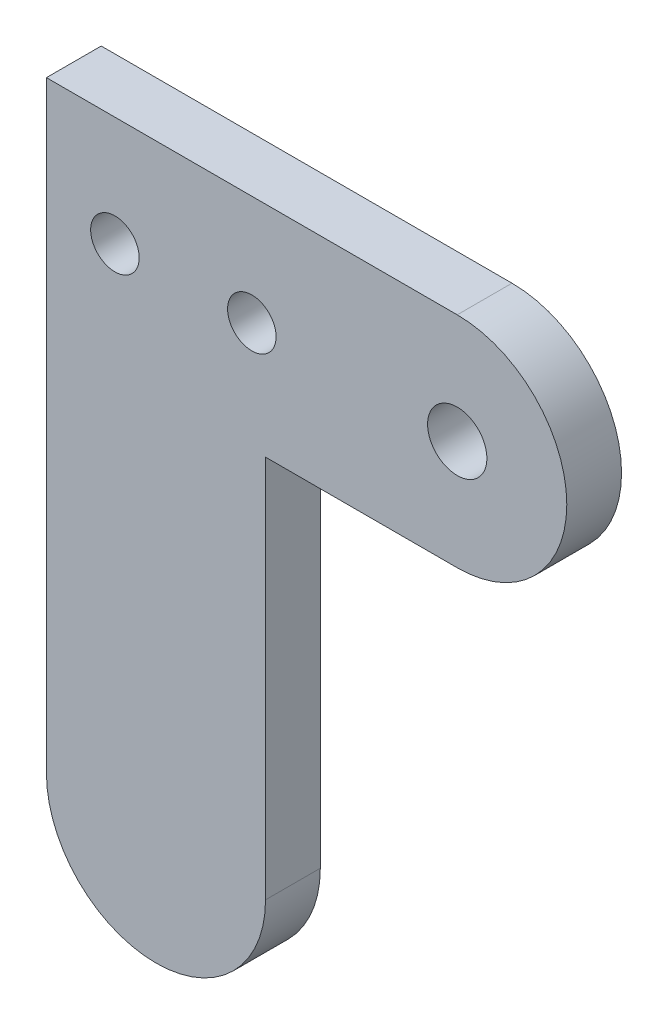
ISO-10303-21;
HEADER;
FILE_DESCRIPTION(('STEP AP214'),'2;1');
FILE_NAME('part.step','',(''),(''),'','','');
FILE_SCHEMA(('AUTOMOTIVE_DESIGN { 1 0 10303 214 1 1 1 1 }'));
ENDSEC;
DATA;
#1=APPLICATION_CONTEXT('core data for automotive mechanical design processes');
#2=APPLICATION_PROTOCOL_DEFINITION('international standard','automotive_design',2000,#1);
#3=PRODUCT_CONTEXT('',#1,'mechanical');
#4=PRODUCT('Part','Part','',(#3));
#5=PRODUCT_RELATED_PRODUCT_CATEGORY('part','',(#4));
#6=PRODUCT_DEFINITION_FORMATION('','',#4);
#7=PRODUCT_DEFINITION_CONTEXT('part definition',#1,'design');
#8=PRODUCT_DEFINITION('design','',#6,#7);
#9=PRODUCT_DEFINITION_SHAPE('','',#8);
#10=(LENGTH_UNIT() NAMED_UNIT(*) SI_UNIT(.MILLI.,.METRE.));
#11=(NAMED_UNIT(*) PLANE_ANGLE_UNIT() SI_UNIT($,.RADIAN.));
#12=(NAMED_UNIT(*) SI_UNIT($,.STERADIAN.) SOLID_ANGLE_UNIT());
#13=UNCERTAINTY_MEASURE_WITH_UNIT(LENGTH_MEASURE(1.E-05),#10,'distance_accuracy_value','');
#14=(GEOMETRIC_REPRESENTATION_CONTEXT(3) GLOBAL_UNCERTAINTY_ASSIGNED_CONTEXT((#13)) GLOBAL_UNIT_ASSIGNED_CONTEXT((#10,
#11,#12)) REPRESENTATION_CONTEXT('',''));
#15=CARTESIAN_POINT('',(0.,0.,0.));
#16=DIRECTION('',(0.,0.,1.));
#17=DIRECTION('',(1.,0.,0.));
#18=AXIS2_PLACEMENT_3D('',#15,#16,#17);
#19=CARTESIAN_POINT('',(38.1,10.16,5.08));
#20=DIRECTION('',(0.,-1.,0.));
#21=DIRECTION('',(1.,0.,0.));
#22=AXIS2_PLACEMENT_3D('',#19,#20,#21);
#23=PLANE('',#22);
#24=DIRECTION('',(-1.,0.,0.));
#25=VECTOR('',#24,1.);
#26=CARTESIAN_POINT('',(38.1,10.16,0.));
#27=LINE('',#26,#25);
#28=CARTESIAN_POINT('',(38.1,10.16,0.));
#29=VERTEX_POINT('',#28);
#30=CARTESIAN_POINT('',(0.,10.16,0.));
#31=VERTEX_POINT('',#30);
#32=EDGE_CURVE('E121',#29,#31,#27,.T.);
#33=ORIENTED_EDGE('',*,*,#32,.T.);
#34=DIRECTION('',(0.,0.,-1.));
#35=VECTOR('',#34,1.);
#36=CARTESIAN_POINT('',(0.,10.16,5.08));
#37=LINE('',#36,#35);
#38=CARTESIAN_POINT('',(0.,10.16,5.08));
#39=VERTEX_POINT('',#38);
#40=EDGE_CURVE('E11',#39,#31,#37,.T.);
#41=ORIENTED_EDGE('',*,*,#40,.F.);
#42=DIRECTION('',(-1.,0.,0.));
#43=VECTOR('',#42,1.);
#44=CARTESIAN_POINT('',(38.1,10.16,5.08));
#45=LINE('',#44,#43);
#46=CARTESIAN_POINT('',(38.1,10.16,5.08));
#47=VERTEX_POINT('',#46);
#48=EDGE_CURVE('E132',#47,#39,#45,.T.);
#49=ORIENTED_EDGE('',*,*,#48,.F.);
#50=DIRECTION('',(0.,0.,-1.));
#51=VECTOR('',#50,1.);
#52=CARTESIAN_POINT('',(38.1,10.16,5.08));
#53=LINE('',#52,#51);
#54=EDGE_CURVE('E117',#47,#29,#53,.T.);
#55=ORIENTED_EDGE('',*,*,#54,.T.);
#56=EDGE_LOOP('',(#33,#41,#49,#55));
#57=FACE_BOUND('',#56,.T.);
#58=ADVANCED_FACE('F37',(#57),#23,.F.);
#59=CARTESIAN_POINT('',(0.,-45.72,5.08));
#60=DIRECTION('',(1.,0.,0.));
#61=DIRECTION('',(0.,1.,0.));
#62=AXIS2_PLACEMENT_3D('',#59,#60,#61);
#63=PLANE('',#62);
#64=DIRECTION('',(0.,-1.,0.));
#65=VECTOR('',#64,1.);
#66=CARTESIAN_POINT('',(0.,-45.72,0.));
#67=LINE('',#66,#65);
#68=CARTESIAN_POINT('',(0.,-45.72,0.));
#69=VERTEX_POINT('',#68);
#70=EDGE_CURVE('E124',#31,#69,#67,.T.);
#71=ORIENTED_EDGE('',*,*,#70,.T.);
#72=DIRECTION('',(0.,0.,-1.));
#73=VECTOR('',#72,1.);
#74=CARTESIAN_POINT('',(0.,-45.72,5.08));
#75=LINE('',#74,#73);
#76=CARTESIAN_POINT('',(0.,-45.72,5.08));
#77=VERTEX_POINT('',#76);
#78=EDGE_CURVE('E45',#77,#69,#75,.T.);
#79=ORIENTED_EDGE('',*,*,#78,.F.);
#80=DIRECTION('',(0.,-1.,0.));
#81=VECTOR('',#80,1.);
#82=CARTESIAN_POINT('',(0.,10.16,5.08));
#83=LINE('',#82,#81);
#84=EDGE_CURVE('E90',#39,#77,#83,.T.);
#85=ORIENTED_EDGE('',*,*,#84,.F.);
#86=ORIENTED_EDGE('',*,*,#40,.T.);
#87=EDGE_LOOP('',(#71,#79,#85,#86));
#88=FACE_BOUND('',#87,.T.);
#89=ADVANCED_FACE('F157',(#88),#63,.F.);
#90=CARTESIAN_POINT('',(10.16,-45.72,5.08));
#91=DIRECTION('',(0.,0.,-1.));
#92=DIRECTION('',(-1.,0.,0.));
#93=AXIS2_PLACEMENT_3D('',#90,#91,#92);
#94=CYLINDRICAL_SURFACE('',#93,10.16);
#95=CARTESIAN_POINT('',(10.16,-45.72,0.));
#96=DIRECTION('',(0.,0.,1.));
#97=DIRECTION('',(-1.,0.,0.));
#98=AXIS2_PLACEMENT_3D('',#95,#96,#97);
#99=CIRCLE('',#98,10.16);
#100=CARTESIAN_POINT('',(20.32,-45.72,0.));
#101=VERTEX_POINT('',#100);
#102=EDGE_CURVE('E127',#69,#101,#99,.T.);
#103=ORIENTED_EDGE('',*,*,#102,.T.);
#104=DIRECTION('',(0.,0.,-1.));
#105=VECTOR('',#104,1.);
#106=CARTESIAN_POINT('',(20.32,-45.72,5.08));
#107=LINE('',#106,#105);
#108=CARTESIAN_POINT('',(20.32,-45.72,5.08));
#109=VERTEX_POINT('',#108);
#110=EDGE_CURVE('E112',#109,#101,#107,.T.);
#111=ORIENTED_EDGE('',*,*,#110,.F.);
#112=CARTESIAN_POINT('',(10.16,-45.72,5.08));
#113=DIRECTION('',(0.,0.,1.));
#114=DIRECTION('',(-1.,0.,0.));
#115=AXIS2_PLACEMENT_3D('',#112,#113,#114);
#116=CIRCLE('',#115,10.16);
#117=EDGE_CURVE('E103',#77,#109,#116,.T.);
#118=ORIENTED_EDGE('',*,*,#117,.F.);
#119=ORIENTED_EDGE('',*,*,#78,.T.);
#120=EDGE_LOOP('',(#103,#111,#118,#119));
#121=FACE_BOUND('',#120,.T.);
#122=ADVANCED_FACE('F138',(#121),#94,.T.);
#123=CARTESIAN_POINT('',(20.32,-10.16,5.08));
#124=DIRECTION('',(-1.,0.,0.));
#125=DIRECTION('',(0.,-1.,0.));
#126=AXIS2_PLACEMENT_3D('',#123,#124,#125);
#127=PLANE('',#126);
#128=DIRECTION('',(0.,1.,0.));
#129=VECTOR('',#128,1.);
#130=CARTESIAN_POINT('',(20.32,-10.16,0.));
#131=LINE('',#130,#129);
#132=CARTESIAN_POINT('',(20.32,-10.16,0.));
#133=VERTEX_POINT('',#132);
#134=EDGE_CURVE('E111',#101,#133,#131,.T.);
#135=ORIENTED_EDGE('',*,*,#134,.T.);
#136=DIRECTION('',(0.,0.,-1.));
#137=VECTOR('',#136,1.);
#138=CARTESIAN_POINT('',(20.32,-10.16,5.08));
#139=LINE('',#138,#137);
#140=CARTESIAN_POINT('',(20.32,-10.16,5.08));
#141=VERTEX_POINT('',#140);
#142=EDGE_CURVE('E108',#141,#133,#139,.T.);
#143=ORIENTED_EDGE('',*,*,#142,.F.);
#144=DIRECTION('',(0.,1.,0.));
#145=VECTOR('',#144,1.);
#146=CARTESIAN_POINT('',(20.32,-10.16,5.08));
#147=LINE('',#146,#145);
#148=EDGE_CURVE('E97',#109,#141,#147,.T.);
#149=ORIENTED_EDGE('',*,*,#148,.F.);
#150=ORIENTED_EDGE('',*,*,#110,.T.);
#151=EDGE_LOOP('',(#135,#143,#149,#150));
#152=FACE_BOUND('',#151,.T.);
#153=ADVANCED_FACE('F109',(#152),#127,.F.);
#154=CARTESIAN_POINT('',(38.1,-10.16,5.08));
#155=DIRECTION('',(0.,1.,0.));
#156=DIRECTION('',(-1.,0.,0.));
#157=AXIS2_PLACEMENT_3D('',#154,#155,#156);
#158=PLANE('',#157);
#159=DIRECTION('',(1.,0.,0.));
#160=VECTOR('',#159,1.);
#161=CARTESIAN_POINT('',(38.1,-10.16,0.));
#162=LINE('',#161,#160);
#163=CARTESIAN_POINT('',(38.1,-10.16,0.));
#164=VERTEX_POINT('',#163);
#165=EDGE_CURVE('E76',#133,#164,#162,.T.);
#166=ORIENTED_EDGE('',*,*,#165,.T.);
#167=DIRECTION('',(0.,0.,-1.));
#168=VECTOR('',#167,1.);
#169=CARTESIAN_POINT('',(38.1,-10.16,5.08));
#170=LINE('',#169,#168);
#171=CARTESIAN_POINT('',(38.1,-10.16,5.08));
#172=VERTEX_POINT('',#171);
#173=EDGE_CURVE('E113',#172,#164,#170,.T.);
#174=ORIENTED_EDGE('',*,*,#173,.F.);
#175=DIRECTION('',(1.,0.,0.));
#176=VECTOR('',#175,1.);
#177=CARTESIAN_POINT('',(38.1,-10.16,5.08));
#178=LINE('',#177,#176);
#179=EDGE_CURVE('E101',#141,#172,#178,.T.);
#180=ORIENTED_EDGE('',*,*,#179,.F.);
#181=ORIENTED_EDGE('',*,*,#142,.T.);
#182=EDGE_LOOP('',(#166,#174,#180,#181));
#183=FACE_BOUND('',#182,.T.);
#184=ADVANCED_FACE('F115',(#183),#158,.F.);
#185=CARTESIAN_POINT('',(38.1,0.,5.08));
#186=DIRECTION('',(0.,0.,-1.));
#187=DIRECTION('',(-1.,0.,0.));
#188=AXIS2_PLACEMENT_3D('',#185,#186,#187);
#189=CYLINDRICAL_SURFACE('',#188,10.16);
#190=CARTESIAN_POINT('',(38.1,0.,0.));
#191=DIRECTION('',(0.,0.,1.));
#192=DIRECTION('',(1.,0.,0.));
#193=AXIS2_PLACEMENT_3D('',#190,#191,#192);
#194=CIRCLE('',#193,10.16);
#195=EDGE_CURVE('E82',#164,#29,#194,.T.);
#196=ORIENTED_EDGE('',*,*,#195,.T.);
#197=ORIENTED_EDGE('',*,*,#54,.F.);
#198=CARTESIAN_POINT('',(38.1,0.,5.08));
#199=DIRECTION('',(0.,0.,1.));
#200=DIRECTION('',(1.,0.,0.));
#201=AXIS2_PLACEMENT_3D('',#198,#199,#200);
#202=CIRCLE('',#201,10.16);
#203=EDGE_CURVE('E53',#172,#47,#202,.T.);
#204=ORIENTED_EDGE('',*,*,#203,.F.);
#205=ORIENTED_EDGE('',*,*,#173,.T.);
#206=EDGE_LOOP('',(#196,#197,#204,#205));
#207=FACE_BOUND('',#206,.T.);
#208=ADVANCED_FACE('F145',(#207),#189,.T.);
#209=CARTESIAN_POINT('',(10.16,-45.72,5.08));
#210=DIRECTION('',(0.,0.,-1.));
#211=DIRECTION('',(-1.,0.,0.));
#212=AXIS2_PLACEMENT_3D('',#209,#210,#211);
#213=PLANE('',#212);
#214=CARTESIAN_POINT('',(19.05,-0.0163113571783296,5.08));
#215=DIRECTION('',(0.,0.,1.));
#216=DIRECTION('',(1.,0.,0.));
#217=AXIS2_PLACEMENT_3D('',#214,#215,#216);
#218=CIRCLE('',#217,2.25);
#219=CARTESIAN_POINT('',(21.3,-0.0163113571783296,5.08));
#220=VERTEX_POINT('',#219);
#221=EDGE_CURVE('E233',#220,#220,#218,.T.);
#222=ORIENTED_EDGE('',*,*,#221,.F.);
#223=EDGE_LOOP('',(#222));
#224=FACE_BOUND('',#223,.T.);
#225=CARTESIAN_POINT('',(6.35,-0.0163113571783296,5.08));
#226=DIRECTION('',(0.,0.,1.));
#227=DIRECTION('',(1.,0.,0.));
#228=AXIS2_PLACEMENT_3D('',#225,#226,#227);
#229=CIRCLE('',#228,2.24999999999999);
#230=CARTESIAN_POINT('',(8.59999999999999,-0.0163113571783296,5.08));
#231=VERTEX_POINT('',#230);
#232=EDGE_CURVE('E235',#231,#231,#229,.T.);
#233=ORIENTED_EDGE('',*,*,#232,.F.);
#234=EDGE_LOOP('',(#233));
#235=FACE_BOUND('',#234,.T.);
#236=CARTESIAN_POINT('',(38.1,0.,5.08));
#237=DIRECTION('',(0.,0.,1.));
#238=DIRECTION('',(1.,0.,0.));
#239=AXIS2_PLACEMENT_3D('',#236,#237,#238);
#240=CIRCLE('',#239,2.74999999999999);
#241=CARTESIAN_POINT('',(40.85,0.,5.08));
#242=VERTEX_POINT('',#241);
#243=EDGE_CURVE('E243',#242,#242,#240,.T.);
#244=ORIENTED_EDGE('',*,*,#243,.F.);
#245=EDGE_LOOP('',(#244));
#246=FACE_BOUND('',#245,.T.);
#247=ORIENTED_EDGE('',*,*,#48,.T.);
#248=ORIENTED_EDGE('',*,*,#84,.T.);
#249=ORIENTED_EDGE('',*,*,#117,.T.);
#250=ORIENTED_EDGE('',*,*,#148,.T.);
#251=ORIENTED_EDGE('',*,*,#179,.T.);
#252=ORIENTED_EDGE('',*,*,#203,.T.);
#253=EDGE_LOOP('',(#247,#248,#249,#250,#251,#252));
#254=FACE_BOUND('',#253,.T.);
#255=ADVANCED_FACE('F99',(#224,#235,#246,#254),#213,.F.);
#256=CARTESIAN_POINT('',(10.16,-45.72,0.));
#257=DIRECTION('',(0.,0.,-1.));
#258=DIRECTION('',(-1.,0.,0.));
#259=AXIS2_PLACEMENT_3D('',#256,#257,#258);
#260=PLANE('',#259);
#261=CARTESIAN_POINT('',(19.05,-0.0163113571783296,0.));
#262=DIRECTION('',(0.,0.,1.));
#263=DIRECTION('',(1.,0.,0.));
#264=AXIS2_PLACEMENT_3D('',#261,#262,#263);
#265=CIRCLE('',#264,2.25);
#266=CARTESIAN_POINT('',(21.3,-0.0163113571783296,0.));
#267=VERTEX_POINT('',#266);
#268=EDGE_CURVE('E230',#267,#267,#265,.T.);
#269=ORIENTED_EDGE('',*,*,#268,.T.);
#270=EDGE_LOOP('',(#269));
#271=FACE_BOUND('',#270,.T.);
#272=CARTESIAN_POINT('',(6.35,-0.0163113571783296,0.));
#273=DIRECTION('',(0.,0.,1.));
#274=DIRECTION('',(1.,0.,0.));
#275=AXIS2_PLACEMENT_3D('',#272,#273,#274);
#276=CIRCLE('',#275,2.24999999999999);
#277=CARTESIAN_POINT('',(8.59999999999999,-0.0163113571783296,0.));
#278=VERTEX_POINT('',#277);
#279=EDGE_CURVE('E240',#278,#278,#276,.T.);
#280=ORIENTED_EDGE('',*,*,#279,.T.);
#281=EDGE_LOOP('',(#280));
#282=FACE_BOUND('',#281,.T.);
#283=CARTESIAN_POINT('',(38.1,0.,0.));
#284=DIRECTION('',(0.,0.,1.));
#285=DIRECTION('',(1.,0.,0.));
#286=AXIS2_PLACEMENT_3D('',#283,#284,#285);
#287=CIRCLE('',#286,2.75);
#288=CARTESIAN_POINT('',(40.85,0.,0.));
#289=VERTEX_POINT('',#288);
#290=EDGE_CURVE('E125',#289,#289,#287,.T.);
#291=ORIENTED_EDGE('',*,*,#290,.T.);
#292=EDGE_LOOP('',(#291));
#293=FACE_BOUND('',#292,.T.);
#294=ORIENTED_EDGE('',*,*,#32,.F.);
#295=ORIENTED_EDGE('',*,*,#195,.F.);
#296=ORIENTED_EDGE('',*,*,#165,.F.);
#297=ORIENTED_EDGE('',*,*,#134,.F.);
#298=ORIENTED_EDGE('',*,*,#102,.F.);
#299=ORIENTED_EDGE('',*,*,#70,.F.);
#300=EDGE_LOOP('',(#294,#295,#296,#297,#298,#299));
#301=FACE_BOUND('',#300,.T.);
#302=ADVANCED_FACE('F141',(#271,#282,#293,#301),#260,.T.);
#303=CARTESIAN_POINT('',(38.1,0.,5.08));
#304=DIRECTION('',(0.,0.,1.));
#305=DIRECTION('',(1.,0.,0.));
#306=AXIS2_PLACEMENT_3D('',#303,#304,#305);
#307=CYLINDRICAL_SURFACE('',#306,2.74999999999999);
#308=ORIENTED_EDGE('',*,*,#290,.F.);
#309=EDGE_LOOP('',(#308));
#310=FACE_BOUND('',#309,.T.);
#311=ORIENTED_EDGE('',*,*,#243,.T.);
#312=EDGE_LOOP('',(#311));
#313=FACE_BOUND('',#312,.T.);
#314=ADVANCED_FACE('F185',(#310,#313),#307,.F.);
#315=CARTESIAN_POINT('',(6.35,-0.0163113571783296,5.08));
#316=DIRECTION('',(0.,0.,1.));
#317=DIRECTION('',(1.,0.,0.));
#318=AXIS2_PLACEMENT_3D('',#315,#316,#317);
#319=CYLINDRICAL_SURFACE('',#318,2.24999999999999);
#320=ORIENTED_EDGE('',*,*,#279,.F.);
#321=EDGE_LOOP('',(#320));
#322=FACE_BOUND('',#321,.T.);
#323=ORIENTED_EDGE('',*,*,#232,.T.);
#324=EDGE_LOOP('',(#323));
#325=FACE_BOUND('',#324,.T.);
#326=ADVANCED_FACE('F190',(#322,#325),#319,.F.);
#327=CARTESIAN_POINT('',(19.05,-0.0163113571783296,5.08));
#328=DIRECTION('',(0.,0.,1.));
#329=DIRECTION('',(1.,0.,0.));
#330=AXIS2_PLACEMENT_3D('',#327,#328,#329);
#331=CYLINDRICAL_SURFACE('',#330,2.25);
#332=ORIENTED_EDGE('',*,*,#268,.F.);
#333=EDGE_LOOP('',(#332));
#334=FACE_BOUND('',#333,.T.);
#335=ORIENTED_EDGE('',*,*,#221,.T.);
#336=EDGE_LOOP('',(#335));
#337=FACE_BOUND('',#336,.T.);
#338=ADVANCED_FACE('F213',(#334,#337),#331,.F.);
#339=CLOSED_SHELL('',(#58,#89,#122,#153,#184,#208,#255,#302,#314,#326,#338));
#340=MANIFOLD_SOLID_BREP('B2',#339);
#341=ADVANCED_BREP_SHAPE_REPRESENTATION('',(#18,#340),#14);
#342=SHAPE_DEFINITION_REPRESENTATION(#9,#341);
ENDSEC;
END-ISO-10303-21;
